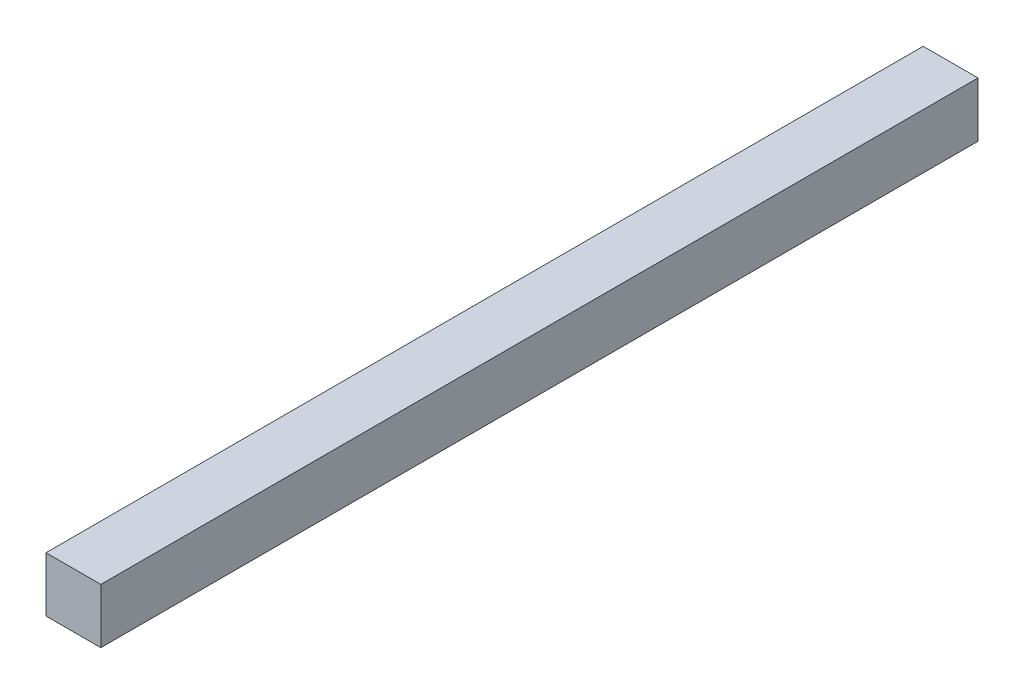
ISO-10303-21;
HEADER;
FILE_DESCRIPTION(('STEP AP214'),'2;1');
FILE_NAME('part.step','',(''),(''),'','','');
FILE_SCHEMA(('AUTOMOTIVE_DESIGN { 1 0 10303 214 1 1 1 1 }'));
ENDSEC;
DATA;
#1=APPLICATION_CONTEXT('core data for automotive mechanical design processes');
#2=APPLICATION_PROTOCOL_DEFINITION('international standard','automotive_design',2000,#1);
#3=PRODUCT_CONTEXT('',#1,'mechanical');
#4=PRODUCT('Part','Part','',(#3));
#5=PRODUCT_RELATED_PRODUCT_CATEGORY('part','',(#4));
#6=PRODUCT_DEFINITION_FORMATION('','',#4);
#7=PRODUCT_DEFINITION_CONTEXT('part definition',#1,'design');
#8=PRODUCT_DEFINITION('design','',#6,#7);
#9=PRODUCT_DEFINITION_SHAPE('','',#8);
#10=(LENGTH_UNIT() NAMED_UNIT(*) SI_UNIT(.MILLI.,.METRE.));
#11=(NAMED_UNIT(*) PLANE_ANGLE_UNIT() SI_UNIT($,.RADIAN.));
#12=(NAMED_UNIT(*) SI_UNIT($,.STERADIAN.) SOLID_ANGLE_UNIT());
#13=UNCERTAINTY_MEASURE_WITH_UNIT(LENGTH_MEASURE(1.E-05),#10,'distance_accuracy_value','');
#14=(GEOMETRIC_REPRESENTATION_CONTEXT(3) GLOBAL_UNCERTAINTY_ASSIGNED_CONTEXT((#13)) GLOBAL_UNIT_ASSIGNED_CONTEXT((#10,
#11,#12)) REPRESENTATION_CONTEXT('',''));
#15=CARTESIAN_POINT('',(0.,0.,0.));
#16=DIRECTION('',(0.,0.,1.));
#17=DIRECTION('',(1.,0.,0.));
#18=AXIS2_PLACEMENT_3D('',#15,#16,#17);
#19=CARTESIAN_POINT('',(-65.770360525713,30.2368670535349,160.));
#20=DIRECTION('',(1.,0.,0.));
#21=DIRECTION('',(0.,0.,-1.));
#22=AXIS2_PLACEMENT_3D('',#19,#20,#21);
#23=PLANE('',#22);
#24=DIRECTION('',(0.,-1.,0.));
#25=VECTOR('',#24,1.);
#26=CARTESIAN_POINT('',(-65.770360525713,30.2368670535349,0.));
#27=LINE('',#26,#25);
#28=CARTESIAN_POINT('',(-65.770360525713,30.2368670535349,0.));
#29=VERTEX_POINT('',#28);
#30=CARTESIAN_POINT('',(-65.770360525713,20.2368670535349,0.));
#31=VERTEX_POINT('',#30);
#32=EDGE_CURVE('E96',#29,#31,#27,.T.);
#33=ORIENTED_EDGE('',*,*,#32,.T.);
#34=DIRECTION('',(0.,0.,-1.));
#35=VECTOR('',#34,1.);
#36=CARTESIAN_POINT('',(-65.770360525713,20.2368670535349,160.));
#37=LINE('',#36,#35);
#38=CARTESIAN_POINT('',(-65.770360525713,20.2368670535349,160.));
#39=VERTEX_POINT('',#38);
#40=EDGE_CURVE('E11',#39,#31,#37,.T.);
#41=ORIENTED_EDGE('',*,*,#40,.F.);
#42=DIRECTION('',(0.,-1.,0.));
#43=VECTOR('',#42,1.);
#44=CARTESIAN_POINT('',(-65.770360525713,30.2368670535349,160.));
#45=LINE('',#44,#43);
#46=CARTESIAN_POINT('',(-65.770360525713,30.2368670535349,160.));
#47=VERTEX_POINT('',#46);
#48=EDGE_CURVE('E84',#47,#39,#45,.T.);
#49=ORIENTED_EDGE('',*,*,#48,.F.);
#50=DIRECTION('',(0.,0.,-1.));
#51=VECTOR('',#50,1.);
#52=CARTESIAN_POINT('',(-65.770360525713,30.2368670535349,160.));
#53=LINE('',#52,#51);
#54=EDGE_CURVE('E92',#47,#29,#53,.T.);
#55=ORIENTED_EDGE('',*,*,#54,.T.);
#56=EDGE_LOOP('',(#33,#41,#49,#55));
#57=FACE_BOUND('',#56,.T.);
#58=ADVANCED_FACE('F33',(#57),#23,.F.);
#59=CARTESIAN_POINT('',(-65.770360525713,20.2368670535349,160.));
#60=DIRECTION('',(0.,1.,0.));
#61=DIRECTION('',(0.,0.,1.));
#62=AXIS2_PLACEMENT_3D('',#59,#60,#61);
#63=PLANE('',#62);
#64=DIRECTION('',(1.,0.,0.));
#65=VECTOR('',#64,1.);
#66=CARTESIAN_POINT('',(-65.770360525713,20.2368670535349,0.));
#67=LINE('',#66,#65);
#68=CARTESIAN_POINT('',(-55.770360525713,20.2368670535349,0.));
#69=VERTEX_POINT('',#68);
#70=EDGE_CURVE('E88',#31,#69,#67,.T.);
#71=ORIENTED_EDGE('',*,*,#70,.T.);
#72=DIRECTION('',(0.,0.,-1.));
#73=VECTOR('',#72,1.);
#74=CARTESIAN_POINT('',(-55.770360525713,20.2368670535349,160.));
#75=LINE('',#74,#73);
#76=CARTESIAN_POINT('',(-55.770360525713,20.2368670535349,160.));
#77=VERTEX_POINT('',#76);
#78=EDGE_CURVE('E41',#77,#69,#75,.T.);
#79=ORIENTED_EDGE('',*,*,#78,.F.);
#80=DIRECTION('',(1.,0.,0.));
#81=VECTOR('',#80,1.);
#82=CARTESIAN_POINT('',(-65.770360525713,20.2368670535349,160.));
#83=LINE('',#82,#81);
#84=EDGE_CURVE('E79',#39,#77,#83,.T.);
#85=ORIENTED_EDGE('',*,*,#84,.F.);
#86=ORIENTED_EDGE('',*,*,#40,.T.);
#87=EDGE_LOOP('',(#71,#79,#85,#86));
#88=FACE_BOUND('',#87,.T.);
#89=ADVANCED_FACE('F87',(#88),#63,.F.);
#90=CARTESIAN_POINT('',(-55.770360525713,30.2368670535349,160.));
#91=DIRECTION('',(-1.,0.,0.));
#92=DIRECTION('',(0.,0.,1.));
#93=AXIS2_PLACEMENT_3D('',#90,#91,#92);
#94=PLANE('',#93);
#95=DIRECTION('',(0.,1.,0.));
#96=VECTOR('',#95,1.);
#97=CARTESIAN_POINT('',(-55.770360525713,30.2368670535349,0.));
#98=LINE('',#97,#96);
#99=CARTESIAN_POINT('',(-55.770360525713,30.2368670535349,0.));
#100=VERTEX_POINT('',#99);
#101=EDGE_CURVE('E66',#69,#100,#98,.T.);
#102=ORIENTED_EDGE('',*,*,#101,.T.);
#103=DIRECTION('',(0.,0.,-1.));
#104=VECTOR('',#103,1.);
#105=CARTESIAN_POINT('',(-55.770360525713,30.2368670535349,160.));
#106=LINE('',#105,#104);
#107=CARTESIAN_POINT('',(-55.770360525713,30.2368670535349,160.));
#108=VERTEX_POINT('',#107);
#109=EDGE_CURVE('E89',#108,#100,#106,.T.);
#110=ORIENTED_EDGE('',*,*,#109,.F.);
#111=DIRECTION('',(0.,1.,0.));
#112=VECTOR('',#111,1.);
#113=CARTESIAN_POINT('',(-55.770360525713,30.2368670535349,160.));
#114=LINE('',#113,#112);
#115=EDGE_CURVE('E82',#77,#108,#114,.T.);
#116=ORIENTED_EDGE('',*,*,#115,.F.);
#117=ORIENTED_EDGE('',*,*,#78,.T.);
#118=EDGE_LOOP('',(#102,#110,#116,#117));
#119=FACE_BOUND('',#118,.T.);
#120=ADVANCED_FACE('F90',(#119),#94,.F.);
#121=CARTESIAN_POINT('',(-65.770360525713,30.2368670535349,160.));
#122=DIRECTION('',(0.,-1.,0.));
#123=DIRECTION('',(0.,0.,-1.));
#124=AXIS2_PLACEMENT_3D('',#121,#122,#123);
#125=PLANE('',#124);
#126=DIRECTION('',(-1.,0.,0.));
#127=VECTOR('',#126,1.);
#128=CARTESIAN_POINT('',(-65.770360525713,30.2368670535349,0.));
#129=LINE('',#128,#127);
#130=EDGE_CURVE('E72',#100,#29,#129,.T.);
#131=ORIENTED_EDGE('',*,*,#130,.T.);
#132=ORIENTED_EDGE('',*,*,#54,.F.);
#133=DIRECTION('',(-1.,0.,0.));
#134=VECTOR('',#133,1.);
#135=CARTESIAN_POINT('',(-65.770360525713,30.2368670535349,160.));
#136=LINE('',#135,#134);
#137=EDGE_CURVE('E49',#108,#47,#136,.T.);
#138=ORIENTED_EDGE('',*,*,#137,.F.);
#139=ORIENTED_EDGE('',*,*,#109,.T.);
#140=EDGE_LOOP('',(#131,#132,#138,#139));
#141=FACE_BOUND('',#140,.T.);
#142=ADVANCED_FACE('F103',(#141),#125,.F.);
#143=CARTESIAN_POINT('',(0.,0.,160.));
#144=DIRECTION('',(0.,0.,1.));
#145=DIRECTION('',(1.,0.,0.));
#146=AXIS2_PLACEMENT_3D('',#143,#144,#145);
#147=PLANE('',#146);
#148=ORIENTED_EDGE('',*,*,#48,.T.);
#149=ORIENTED_EDGE('',*,*,#84,.T.);
#150=ORIENTED_EDGE('',*,*,#115,.T.);
#151=ORIENTED_EDGE('',*,*,#137,.T.);
#152=EDGE_LOOP('',(#148,#149,#150,#151));
#153=FACE_BOUND('',#152,.T.);
#154=ADVANCED_FACE('F80',(#153),#147,.T.);
#155=CARTESIAN_POINT('',(0.,0.,0.));
#156=DIRECTION('',(0.,0.,1.));
#157=DIRECTION('',(1.,0.,0.));
#158=AXIS2_PLACEMENT_3D('',#155,#156,#157);
#159=PLANE('',#158);
#160=ORIENTED_EDGE('',*,*,#32,.F.);
#161=ORIENTED_EDGE('',*,*,#130,.F.);
#162=ORIENTED_EDGE('',*,*,#101,.F.);
#163=ORIENTED_EDGE('',*,*,#70,.F.);
#164=EDGE_LOOP('',(#160,#161,#162,#163));
#165=FACE_BOUND('',#164,.T.);
#166=ADVANCED_FACE('F106',(#165),#159,.F.);
#167=CLOSED_SHELL('',(#58,#89,#120,#142,#154,#166));
#168=MANIFOLD_SOLID_BREP('B2',#167);
#169=ADVANCED_BREP_SHAPE_REPRESENTATION('',(#18,#168),#14);
#170=SHAPE_DEFINITION_REPRESENTATION(#9,#169);
ENDSEC;
END-ISO-10303-21;
